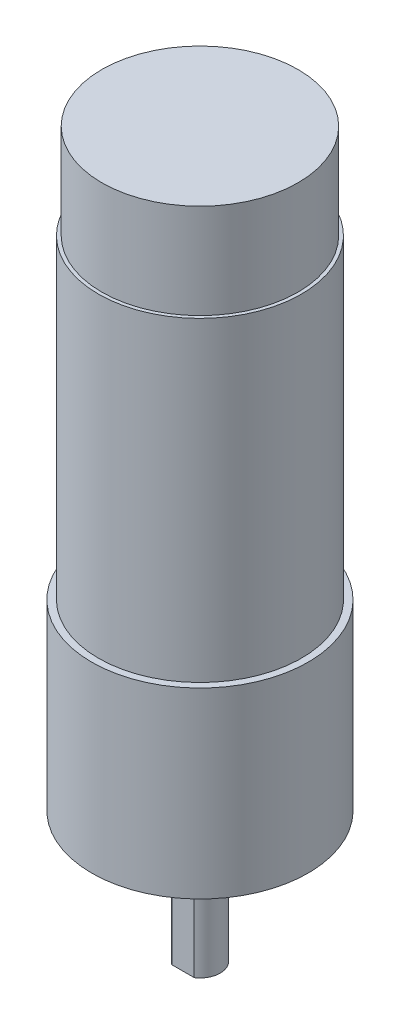
ISO-10303-21;
HEADER;
FILE_DESCRIPTION(('STEP AP214'),'2;1');
FILE_NAME('part.step','',(''),(''),'','','');
FILE_SCHEMA(('AUTOMOTIVE_DESIGN { 1 0 10303 214 1 1 1 1 }'));
ENDSEC;
DATA;
#1=APPLICATION_CONTEXT('core data for automotive mechanical design processes');
#2=APPLICATION_PROTOCOL_DEFINITION('international standard','automotive_design',2000,#1);
#3=PRODUCT_CONTEXT('',#1,'mechanical');
#4=PRODUCT('Part','Part','',(#3));
#5=PRODUCT_RELATED_PRODUCT_CATEGORY('part','',(#4));
#6=PRODUCT_DEFINITION_FORMATION('','',#4);
#7=PRODUCT_DEFINITION_CONTEXT('part definition',#1,'design');
#8=PRODUCT_DEFINITION('design','',#6,#7);
#9=PRODUCT_DEFINITION_SHAPE('','',#8);
#10=(LENGTH_UNIT() NAMED_UNIT(*) SI_UNIT(.MILLI.,.METRE.));
#11=(NAMED_UNIT(*) PLANE_ANGLE_UNIT() SI_UNIT($,.RADIAN.));
#12=(NAMED_UNIT(*) SI_UNIT($,.STERADIAN.) SOLID_ANGLE_UNIT());
#13=UNCERTAINTY_MEASURE_WITH_UNIT(LENGTH_MEASURE(1.E-05),#10,'distance_accuracy_value','');
#14=(GEOMETRIC_REPRESENTATION_CONTEXT(3) GLOBAL_UNCERTAINTY_ASSIGNED_CONTEXT((#13)) GLOBAL_UNIT_ASSIGNED_CONTEXT((#10,
#11,#12)) REPRESENTATION_CONTEXT('',''));
#15=CARTESIAN_POINT('',(0.,0.,0.));
#16=DIRECTION('',(0.,0.,1.));
#17=DIRECTION('',(1.,0.,0.));
#18=AXIS2_PLACEMENT_3D('',#15,#16,#17);
#19=CARTESIAN_POINT('',(0.,73.6,0.));
#20=DIRECTION('',(0.,1.,0.));
#21=DIRECTION('',(0.,0.,1.));
#22=AXIS2_PLACEMENT_3D('',#19,#20,#21);
#23=PLANE('',#22);
#24=CARTESIAN_POINT('',(0.,73.6,0.));
#25=DIRECTION('',(0.,1.,0.));
#26=DIRECTION('',(0.,0.,1.));
#27=AXIS2_PLACEMENT_3D('',#24,#25,#26);
#28=CIRCLE('',#27,15.);
#29=CARTESIAN_POINT('',(0.,73.6,15.));
#30=VERTEX_POINT('',#29);
#31=EDGE_CURVE('E92',#30,#30,#28,.T.);
#32=ORIENTED_EDGE('',*,*,#31,.T.);
#33=EDGE_LOOP('',(#32));
#34=FACE_BOUND('',#33,.T.);
#35=CARTESIAN_POINT('',(0.,73.6,0.));
#36=DIRECTION('',(0.,1.,0.));
#37=DIRECTION('',(0.,0.,1.));
#38=AXIS2_PLACEMENT_3D('',#35,#36,#37);
#39=CIRCLE('',#38,14.5);
#40=CARTESIAN_POINT('',(0.,73.6,14.5));
#41=VERTEX_POINT('',#40);
#42=EDGE_CURVE('E404',#41,#41,#39,.T.);
#43=ORIENTED_EDGE('',*,*,#42,.F.);
#44=EDGE_LOOP('',(#43));
#45=FACE_BOUND('',#44,.T.);
#46=ADVANCED_FACE('F32',(#34,#45),#23,.T.);
#47=CARTESIAN_POINT('',(0.,27.,0.));
#48=DIRECTION('',(0.,1.,0.));
#49=DIRECTION('',(0.,0.,1.));
#50=AXIS2_PLACEMENT_3D('',#47,#48,#49);
#51=PLANE('',#50);
#52=CARTESIAN_POINT('',(0.,27.,0.));
#53=DIRECTION('',(0.,1.,0.));
#54=DIRECTION('',(0.,0.,1.));
#55=AXIS2_PLACEMENT_3D('',#52,#53,#54);
#56=CIRCLE('',#55,16.);
#57=CARTESIAN_POINT('',(0.,27.,16.));
#58=VERTEX_POINT('',#57);
#59=EDGE_CURVE('E40',#58,#58,#56,.T.);
#60=ORIENTED_EDGE('',*,*,#59,.T.);
#61=EDGE_LOOP('',(#60));
#62=FACE_BOUND('',#61,.T.);
#63=CARTESIAN_POINT('',(0.,27.,0.));
#64=DIRECTION('',(0.,1.,0.));
#65=DIRECTION('',(0.,0.,1.));
#66=AXIS2_PLACEMENT_3D('',#63,#64,#65);
#67=CIRCLE('',#66,15.);
#68=CARTESIAN_POINT('',(0.,27.,15.));
#69=VERTEX_POINT('',#68);
#70=EDGE_CURVE('E432',#69,#69,#67,.T.);
#71=ORIENTED_EDGE('',*,*,#70,.F.);
#72=EDGE_LOOP('',(#71));
#73=FACE_BOUND('',#72,.T.);
#74=ADVANCED_FACE('F139',(#62,#73),#51,.T.);
#75=CARTESIAN_POINT('',(0.,-3.,0.));
#76=DIRECTION('',(0.,1.,0.));
#77=DIRECTION('',(0.,0.,1.));
#78=AXIS2_PLACEMENT_3D('',#75,#76,#77);
#79=PLANE('',#78);
#80=CARTESIAN_POINT('',(0.,-3.,0.));
#81=DIRECTION('',(0.,-1.,0.));
#82=DIRECTION('',(0.,0.,1.));
#83=AXIS2_PLACEMENT_3D('',#80,#81,#82);
#84=CIRCLE('',#83,10.);
#85=CARTESIAN_POINT('',(9.,-3.,4.35889894354067));
#86=VERTEX_POINT('',#85);
#87=CARTESIAN_POINT('',(-9.,-3.,4.35889894354068));
#88=VERTEX_POINT('',#87);
#89=EDGE_CURVE('E114',#86,#88,#84,.T.);
#90=ORIENTED_EDGE('',*,*,#89,.T.);
#91=DIRECTION('',(0.,0.,-1.));
#92=VECTOR('',#91,1.);
#93=CARTESIAN_POINT('',(-9.,-3.,4.35889894354068));
#94=LINE('',#93,#92);
#95=CARTESIAN_POINT('',(-9.,-3.,-4.35889894354068));
#96=VERTEX_POINT('',#95);
#97=EDGE_CURVE('E117',#88,#96,#94,.T.);
#98=ORIENTED_EDGE('',*,*,#97,.T.);
#99=CARTESIAN_POINT('',(0.,-3.,0.));
#100=DIRECTION('',(0.,-1.,0.));
#101=DIRECTION('',(0.,0.,1.));
#102=AXIS2_PLACEMENT_3D('',#99,#100,#101);
#103=CIRCLE('',#102,9.99999999999999);
#104=CARTESIAN_POINT('',(9.,-3.,-4.35889894354067));
#105=VERTEX_POINT('',#104);
#106=EDGE_CURVE('E119',#96,#105,#103,.T.);
#107=ORIENTED_EDGE('',*,*,#106,.T.);
#108=DIRECTION('',(0.,0.,1.));
#109=VECTOR('',#108,1.);
#110=CARTESIAN_POINT('',(9.,-3.,4.35889894354067));
#111=LINE('',#110,#109);
#112=EDGE_CURVE('E121',#105,#86,#111,.T.);
#113=ORIENTED_EDGE('',*,*,#112,.T.);
#114=EDGE_LOOP('',(#90,#98,#107,#113));
#115=FACE_BOUND('',#114,.T.);
#116=CARTESIAN_POINT('',(0.,-3.,0.));
#117=DIRECTION('',(0.,1.,0.));
#118=DIRECTION('',(0.,0.,1.));
#119=AXIS2_PLACEMENT_3D('',#116,#117,#118);
#120=CIRCLE('',#119,3.);
#121=CARTESIAN_POINT('',(0.,-3.,3.));
#122=VERTEX_POINT('',#121);
#123=EDGE_CURVE('E11',#122,#122,#120,.F.);
#124=ORIENTED_EDGE('',*,*,#123,.F.);
#125=EDGE_LOOP('',(#124));
#126=FACE_BOUND('',#125,.T.);
#127=ADVANCED_FACE('F149',(#115,#126),#79,.F.);
#128=CARTESIAN_POINT('',(0.,0.,0.));
#129=DIRECTION('',(0.,1.,0.));
#130=DIRECTION('',(0.,0.,1.));
#131=AXIS2_PLACEMENT_3D('',#128,#129,#130);
#132=PLANE('',#131);
#133=CARTESIAN_POINT('',(-9.1923881554251,0.,-9.19238815542513));
#134=DIRECTION('',(0.,-1.,0.));
#135=DIRECTION('',(0.,0.,-1.));
#136=AXIS2_PLACEMENT_3D('',#133,#134,#135);
#137=CIRCLE('',#136,1.5);
#138=CARTESIAN_POINT('',(-9.1923881554251,0.,-10.6923881554251));
#139=VERTEX_POINT('',#138);
#140=EDGE_CURVE('E403',#139,#139,#137,.T.);
#141=ORIENTED_EDGE('',*,*,#140,.F.);
#142=EDGE_LOOP('',(#141));
#143=FACE_BOUND('',#142,.T.);
#144=CARTESIAN_POINT('',(9.1923881554251,0.,-9.19238815542513));
#145=DIRECTION('',(0.,-1.,0.));
#146=DIRECTION('',(0.,0.,1.));
#147=AXIS2_PLACEMENT_3D('',#144,#145,#146);
#148=CIRCLE('',#147,1.5);
#149=CARTESIAN_POINT('',(9.1923881554251,0.,-7.69238815542513));
#150=VERTEX_POINT('',#149);
#151=EDGE_CURVE('E414',#150,#150,#148,.T.);
#152=ORIENTED_EDGE('',*,*,#151,.F.);
#153=EDGE_LOOP('',(#152));
#154=FACE_BOUND('',#153,.T.);
#155=CARTESIAN_POINT('',(-9.1923881554251,0.,9.19238815542513));
#156=DIRECTION('',(0.,-1.,0.));
#157=DIRECTION('',(0.,0.,1.));
#158=AXIS2_PLACEMENT_3D('',#155,#156,#157);
#159=CIRCLE('',#158,1.5);
#160=CARTESIAN_POINT('',(-9.1923881554251,0.,10.6923881554251));
#161=VERTEX_POINT('',#160);
#162=EDGE_CURVE('E420',#161,#161,#159,.T.);
#163=ORIENTED_EDGE('',*,*,#162,.F.);
#164=EDGE_LOOP('',(#163));
#165=FACE_BOUND('',#164,.T.);
#166=CARTESIAN_POINT('',(9.1923881554251,0.,9.19238815542513));
#167=DIRECTION('',(0.,-1.,0.));
#168=DIRECTION('',(0.,0.,-1.));
#169=AXIS2_PLACEMENT_3D('',#166,#167,#168);
#170=CIRCLE('',#169,1.5);
#171=CARTESIAN_POINT('',(9.1923881554251,0.,7.69238815542513));
#172=VERTEX_POINT('',#171);
#173=EDGE_CURVE('E426',#172,#172,#170,.T.);
#174=ORIENTED_EDGE('',*,*,#173,.F.);
#175=EDGE_LOOP('',(#174));
#176=FACE_BOUND('',#175,.T.);
#177=CARTESIAN_POINT('',(0.,0.,0.));
#178=DIRECTION('',(0.,1.,0.));
#179=DIRECTION('',(0.,0.,1.));
#180=AXIS2_PLACEMENT_3D('',#177,#178,#179);
#181=CIRCLE('',#180,16.);
#182=CARTESIAN_POINT('',(0.,0.,16.));
#183=VERTEX_POINT('',#182);
#184=EDGE_CURVE('E134',#183,#183,#181,.T.);
#185=ORIENTED_EDGE('',*,*,#184,.F.);
#186=EDGE_LOOP('',(#185));
#187=FACE_BOUND('',#186,.T.);
#188=CARTESIAN_POINT('',(0.,0.,0.));
#189=DIRECTION('',(0.,-1.,0.));
#190=DIRECTION('',(0.,0.,1.));
#191=AXIS2_PLACEMENT_3D('',#188,#189,#190);
#192=CIRCLE('',#191,10.);
#193=CARTESIAN_POINT('',(9.,0.,4.35889894354067));
#194=VERTEX_POINT('',#193);
#195=CARTESIAN_POINT('',(-9.,0.,4.35889894354068));
#196=VERTEX_POINT('',#195);
#197=EDGE_CURVE('E101',#194,#196,#192,.T.);
#198=ORIENTED_EDGE('',*,*,#197,.F.);
#199=DIRECTION('',(0.,0.,1.));
#200=VECTOR('',#199,1.);
#201=CARTESIAN_POINT('',(9.,0.,4.35889894354067));
#202=LINE('',#201,#200);
#203=CARTESIAN_POINT('',(9.,0.,-4.35889894354067));
#204=VERTEX_POINT('',#203);
#205=EDGE_CURVE('E111',#204,#194,#202,.T.);
#206=ORIENTED_EDGE('',*,*,#205,.F.);
#207=CARTESIAN_POINT('',(0.,0.,0.));
#208=DIRECTION('',(0.,-1.,0.));
#209=DIRECTION('',(0.,0.,1.));
#210=AXIS2_PLACEMENT_3D('',#207,#208,#209);
#211=CIRCLE('',#210,9.99999999999999);
#212=CARTESIAN_POINT('',(-9.,0.,-4.35889894354068));
#213=VERTEX_POINT('',#212);
#214=EDGE_CURVE('E108',#213,#204,#211,.T.);
#215=ORIENTED_EDGE('',*,*,#214,.F.);
#216=DIRECTION('',(0.,0.,-1.));
#217=VECTOR('',#216,1.);
#218=CARTESIAN_POINT('',(-9.,0.,4.35889894354068));
#219=LINE('',#218,#217);
#220=EDGE_CURVE('E55',#196,#213,#219,.T.);
#221=ORIENTED_EDGE('',*,*,#220,.F.);
#222=EDGE_LOOP('',(#198,#206,#215,#221));
#223=FACE_BOUND('',#222,.T.);
#224=ADVANCED_FACE('F145',(#143,#154,#165,#176,#187,#223),#132,.F.);
#225=CARTESIAN_POINT('',(0.,27.,0.));
#226=DIRECTION('',(0.,-1.,0.));
#227=DIRECTION('',(0.,0.,-1.));
#228=AXIS2_PLACEMENT_3D('',#225,#226,#227);
#229=CYLINDRICAL_SURFACE('',#228,16.);
#230=ORIENTED_EDGE('',*,*,#59,.F.);
#231=EDGE_LOOP('',(#230));
#232=FACE_BOUND('',#231,.T.);
#233=ORIENTED_EDGE('',*,*,#184,.T.);
#234=EDGE_LOOP('',(#233));
#235=FACE_BOUND('',#234,.T.);
#236=ADVANCED_FACE('F34',(#232,#235),#229,.T.);
#237=CARTESIAN_POINT('',(0.,-3.,0.));
#238=DIRECTION('',(0.,1.,0.));
#239=DIRECTION('',(0.,0.,1.));
#240=AXIS2_PLACEMENT_3D('',#237,#238,#239);
#241=CYLINDRICAL_SURFACE('',#240,10.);
#242=ORIENTED_EDGE('',*,*,#197,.T.);
#243=DIRECTION('',(0.,1.,0.));
#244=VECTOR('',#243,1.);
#245=CARTESIAN_POINT('',(-9.,-3.,4.35889894354068));
#246=LINE('',#245,#244);
#247=EDGE_CURVE('E132',#88,#196,#246,.T.);
#248=ORIENTED_EDGE('',*,*,#247,.F.);
#249=ORIENTED_EDGE('',*,*,#89,.F.);
#250=DIRECTION('',(0.,1.,0.));
#251=VECTOR('',#250,1.);
#252=CARTESIAN_POINT('',(9.,-3.,4.35889894354067));
#253=LINE('',#252,#251);
#254=EDGE_CURVE('E123',#86,#194,#253,.T.);
#255=ORIENTED_EDGE('',*,*,#254,.T.);
#256=EDGE_LOOP('',(#242,#248,#249,#255));
#257=FACE_BOUND('',#256,.T.);
#258=ADVANCED_FACE('F144',(#257),#241,.T.);
#259=CARTESIAN_POINT('',(-9.,-3.,4.35889894354068));
#260=DIRECTION('',(1.,0.,0.));
#261=DIRECTION('',(0.,0.,-1.));
#262=AXIS2_PLACEMENT_3D('',#259,#260,#261);
#263=PLANE('',#262);
#264=ORIENTED_EDGE('',*,*,#220,.T.);
#265=DIRECTION('',(0.,1.,0.));
#266=VECTOR('',#265,1.);
#267=CARTESIAN_POINT('',(-9.,-3.,-4.35889894354068));
#268=LINE('',#267,#266);
#269=EDGE_CURVE('E129',#96,#213,#268,.T.);
#270=ORIENTED_EDGE('',*,*,#269,.F.);
#271=ORIENTED_EDGE('',*,*,#97,.F.);
#272=ORIENTED_EDGE('',*,*,#247,.T.);
#273=EDGE_LOOP('',(#264,#270,#271,#272));
#274=FACE_BOUND('',#273,.T.);
#275=ADVANCED_FACE('F167',(#274),#263,.F.);
#276=CARTESIAN_POINT('',(0.,-3.,0.));
#277=DIRECTION('',(0.,1.,0.));
#278=DIRECTION('',(0.,0.,1.));
#279=AXIS2_PLACEMENT_3D('',#276,#277,#278);
#280=CYLINDRICAL_SURFACE('',#279,9.99999999999999);
#281=ORIENTED_EDGE('',*,*,#214,.T.);
#282=DIRECTION('',(0.,1.,0.));
#283=VECTOR('',#282,1.);
#284=CARTESIAN_POINT('',(9.,-3.,-4.35889894354067));
#285=LINE('',#284,#283);
#286=EDGE_CURVE('E126',#105,#204,#285,.T.);
#287=ORIENTED_EDGE('',*,*,#286,.F.);
#288=ORIENTED_EDGE('',*,*,#106,.F.);
#289=ORIENTED_EDGE('',*,*,#269,.T.);
#290=EDGE_LOOP('',(#281,#287,#288,#289));
#291=FACE_BOUND('',#290,.T.);
#292=ADVANCED_FACE('F165',(#291),#280,.T.);
#293=CARTESIAN_POINT('',(9.,-3.,4.35889894354067));
#294=DIRECTION('',(-1.,0.,0.));
#295=DIRECTION('',(0.,0.,1.));
#296=AXIS2_PLACEMENT_3D('',#293,#294,#295);
#297=PLANE('',#296);
#298=ORIENTED_EDGE('',*,*,#205,.T.);
#299=ORIENTED_EDGE('',*,*,#254,.F.);
#300=ORIENTED_EDGE('',*,*,#112,.F.);
#301=ORIENTED_EDGE('',*,*,#286,.T.);
#302=EDGE_LOOP('',(#298,#299,#300,#301));
#303=FACE_BOUND('',#302,.T.);
#304=ADVANCED_FACE('F156',(#303),#297,.F.);
#305=CARTESIAN_POINT('',(0.,-19.3,0.));
#306=DIRECTION('',(0.,1.,0.));
#307=DIRECTION('',(0.,0.,1.));
#308=AXIS2_PLACEMENT_3D('',#305,#306,#307);
#309=CYLINDRICAL_SURFACE('',#308,3.);
#310=CARTESIAN_POINT('',(0.,-19.3,0.));
#311=DIRECTION('',(0.,-1.,0.));
#312=DIRECTION('',(0.,0.,-1.));
#313=AXIS2_PLACEMENT_3D('',#310,#311,#312);
#314=CIRCLE('',#313,3.);
#315=CARTESIAN_POINT('',(-1.6583123951777,-19.3,2.5));
#316=VERTEX_POINT('',#315);
#317=CARTESIAN_POINT('',(1.6583123951777,-19.3,2.5));
#318=VERTEX_POINT('',#317);
#319=EDGE_CURVE('E98',#316,#318,#314,.T.);
#320=ORIENTED_EDGE('',*,*,#319,.F.);
#321=DIRECTION('',(0.,-1.,0.));
#322=VECTOR('',#321,1.);
#323=CARTESIAN_POINT('',(-1.6583123951777,-7.3,2.5));
#324=LINE('',#323,#322);
#325=CARTESIAN_POINT('',(-1.6583123951777,-7.3,2.5));
#326=VERTEX_POINT('',#325);
#327=EDGE_CURVE('E47',#326,#316,#324,.T.);
#328=ORIENTED_EDGE('',*,*,#327,.F.);
#329=CARTESIAN_POINT('',(0.,-7.3,0.));
#330=DIRECTION('',(0.,-1.,0.));
#331=DIRECTION('',(0.,0.,-1.));
#332=AXIS2_PLACEMENT_3D('',#329,#330,#331);
#333=CIRCLE('',#332,3.);
#334=CARTESIAN_POINT('',(1.6583123951777,-7.3,2.5));
#335=VERTEX_POINT('',#334);
#336=EDGE_CURVE('E91',#335,#326,#333,.T.);
#337=ORIENTED_EDGE('',*,*,#336,.F.);
#338=DIRECTION('',(0.,-1.,0.));
#339=VECTOR('',#338,1.);
#340=CARTESIAN_POINT('',(1.6583123951777,-7.3,2.5));
#341=LINE('',#340,#339);
#342=EDGE_CURVE('E86',#335,#318,#341,.T.);
#343=ORIENTED_EDGE('',*,*,#342,.T.);
#344=EDGE_LOOP('',(#320,#328,#337,#343));
#345=FACE_BOUND('',#344,.T.);
#346=ORIENTED_EDGE('',*,*,#123,.T.);
#347=EDGE_LOOP('',(#346));
#348=FACE_BOUND('',#347,.T.);
#349=ADVANCED_FACE('F96',(#345,#348),#309,.T.);
#350=CARTESIAN_POINT('',(0.,-19.3,0.));
#351=DIRECTION('',(0.,-1.,0.));
#352=DIRECTION('',(0.,0.,-1.));
#353=AXIS2_PLACEMENT_3D('',#350,#351,#352);
#354=PLANE('',#353);
#355=DIRECTION('',(1.,0.,0.));
#356=VECTOR('',#355,1.);
#357=CARTESIAN_POINT('',(0.,-19.3,2.5));
#358=LINE('',#357,#356);
#359=EDGE_CURVE('E83',#316,#318,#358,.T.);
#360=ORIENTED_EDGE('',*,*,#359,.F.);
#361=ORIENTED_EDGE('',*,*,#319,.T.);
#362=EDGE_LOOP('',(#360,#361));
#363=FACE_BOUND('',#362,.T.);
#364=ADVANCED_FACE('F100',(#363),#354,.T.);
#365=CARTESIAN_POINT('',(0.,-7.3,2.5));
#366=DIRECTION('',(0.,0.,-1.));
#367=DIRECTION('',(-1.,0.,0.));
#368=AXIS2_PLACEMENT_3D('',#365,#366,#367);
#369=PLANE('',#368);
#370=ORIENTED_EDGE('',*,*,#359,.T.);
#371=ORIENTED_EDGE('',*,*,#342,.F.);
#372=DIRECTION('',(1.,0.,0.));
#373=VECTOR('',#372,1.);
#374=CARTESIAN_POINT('',(0.,-7.3,2.5));
#375=LINE('',#374,#373);
#376=EDGE_CURVE('E437',#326,#335,#375,.T.);
#377=ORIENTED_EDGE('',*,*,#376,.F.);
#378=ORIENTED_EDGE('',*,*,#327,.T.);
#379=EDGE_LOOP('',(#370,#371,#377,#378));
#380=FACE_BOUND('',#379,.T.);
#381=ADVANCED_FACE('F85',(#380),#369,.F.);
#382=CARTESIAN_POINT('',(0.,-7.3,-6.74142135623731));
#383=DIRECTION('',(0.,-1.,0.));
#384=DIRECTION('',(0.,0.,-1.));
#385=AXIS2_PLACEMENT_3D('',#382,#383,#384);
#386=PLANE('',#385);
#387=ORIENTED_EDGE('',*,*,#336,.T.);
#388=ORIENTED_EDGE('',*,*,#376,.T.);
#389=EDGE_LOOP('',(#387,#388));
#390=FACE_BOUND('',#389,.T.);
#391=ADVANCED_FACE('F191',(#390),#386,.T.);
#392=CARTESIAN_POINT('',(0.,73.6,0.));
#393=DIRECTION('',(0.,-1.,0.));
#394=DIRECTION('',(0.,0.,-1.));
#395=AXIS2_PLACEMENT_3D('',#392,#393,#394);
#396=CYLINDRICAL_SURFACE('',#395,15.);
#397=ORIENTED_EDGE('',*,*,#31,.F.);
#398=EDGE_LOOP('',(#397));
#399=FACE_BOUND('',#398,.T.);
#400=ORIENTED_EDGE('',*,*,#70,.T.);
#401=EDGE_LOOP('',(#400));
#402=FACE_BOUND('',#401,.T.);
#403=ADVANCED_FACE('F188',(#399,#402),#396,.T.);
#404=CARTESIAN_POINT('',(9.1923881554251,5.5,9.19238815542513));
#405=DIRECTION('',(0.,-1.,0.));
#406=DIRECTION('',(0.,0.,-1.));
#407=AXIS2_PLACEMENT_3D('',#404,#405,#406);
#408=CYLINDRICAL_SURFACE('',#407,1.5);
#409=CARTESIAN_POINT('',(9.1923881554251,5.5,9.19238815542513));
#410=DIRECTION('',(0.,-1.,0.));
#411=DIRECTION('',(0.,0.,-1.));
#412=AXIS2_PLACEMENT_3D('',#409,#410,#411);
#413=CIRCLE('',#412,1.5);
#414=CARTESIAN_POINT('',(9.1923881554251,5.5,7.69238815542513));
#415=VERTEX_POINT('',#414);
#416=EDGE_CURVE('E429',#415,#415,#413,.T.);
#417=ORIENTED_EDGE('',*,*,#416,.F.);
#418=EDGE_LOOP('',(#417));
#419=FACE_BOUND('',#418,.T.);
#420=ORIENTED_EDGE('',*,*,#173,.T.);
#421=EDGE_LOOP('',(#420));
#422=FACE_BOUND('',#421,.T.);
#423=ADVANCED_FACE('F186',(#419,#422),#408,.F.);
#424=CARTESIAN_POINT('',(9.1923881554251,5.5,9.19238815542513));
#425=DIRECTION('',(0.,-1.,0.));
#426=DIRECTION('',(0.,0.,-1.));
#427=AXIS2_PLACEMENT_3D('',#424,#425,#426);
#428=PLANE('',#427);
#429=ORIENTED_EDGE('',*,*,#416,.T.);
#430=EDGE_LOOP('',(#429));
#431=FACE_BOUND('',#430,.T.);
#432=ADVANCED_FACE('F240',(#431),#428,.T.);
#433=CARTESIAN_POINT('',(-9.1923881554251,5.5,9.19238815542513));
#434=DIRECTION('',(0.,-1.,0.));
#435=DIRECTION('',(0.,0.,-1.));
#436=AXIS2_PLACEMENT_3D('',#433,#434,#435);
#437=CYLINDRICAL_SURFACE('',#436,1.5);
#438=CARTESIAN_POINT('',(-9.1923881554251,5.5,9.19238815542513));
#439=DIRECTION('',(0.,-1.,0.));
#440=DIRECTION('',(0.,0.,1.));
#441=AXIS2_PLACEMENT_3D('',#438,#439,#440);
#442=CIRCLE('',#441,1.5);
#443=CARTESIAN_POINT('',(-9.1923881554251,5.5,10.6923881554251));
#444=VERTEX_POINT('',#443);
#445=EDGE_CURVE('E423',#444,#444,#442,.T.);
#446=ORIENTED_EDGE('',*,*,#445,.F.);
#447=EDGE_LOOP('',(#446));
#448=FACE_BOUND('',#447,.T.);
#449=ORIENTED_EDGE('',*,*,#162,.T.);
#450=EDGE_LOOP('',(#449));
#451=FACE_BOUND('',#450,.T.);
#452=ADVANCED_FACE('F247',(#448,#451),#437,.F.);
#453=CARTESIAN_POINT('',(-9.1923881554251,5.5,9.19238815542513));
#454=DIRECTION('',(0.,1.,0.));
#455=DIRECTION('',(0.,0.,1.));
#456=AXIS2_PLACEMENT_3D('',#453,#454,#455);
#457=PLANE('',#456);
#458=ORIENTED_EDGE('',*,*,#445,.T.);
#459=EDGE_LOOP('',(#458));
#460=FACE_BOUND('',#459,.T.);
#461=ADVANCED_FACE('F254',(#460),#457,.F.);
#462=CARTESIAN_POINT('',(9.1923881554251,5.5,-9.19238815542513));
#463=DIRECTION('',(0.,-1.,0.));
#464=DIRECTION('',(0.,0.,-1.));
#465=AXIS2_PLACEMENT_3D('',#462,#463,#464);
#466=CYLINDRICAL_SURFACE('',#465,1.5);
#467=CARTESIAN_POINT('',(9.1923881554251,5.5,-9.19238815542513));
#468=DIRECTION('',(0.,-1.,0.));
#469=DIRECTION('',(0.,0.,1.));
#470=AXIS2_PLACEMENT_3D('',#467,#468,#469);
#471=CIRCLE('',#470,1.5);
#472=CARTESIAN_POINT('',(9.1923881554251,5.5,-7.69238815542513));
#473=VERTEX_POINT('',#472);
#474=EDGE_CURVE('E417',#473,#473,#471,.T.);
#475=ORIENTED_EDGE('',*,*,#474,.F.);
#476=EDGE_LOOP('',(#475));
#477=FACE_BOUND('',#476,.T.);
#478=ORIENTED_EDGE('',*,*,#151,.T.);
#479=EDGE_LOOP('',(#478));
#480=FACE_BOUND('',#479,.T.);
#481=ADVANCED_FACE('F262',(#477,#480),#466,.F.);
#482=CARTESIAN_POINT('',(9.1923881554251,5.5,-9.19238815542513));
#483=DIRECTION('',(0.,1.,0.));
#484=DIRECTION('',(0.,0.,1.));
#485=AXIS2_PLACEMENT_3D('',#482,#483,#484);
#486=PLANE('',#485);
#487=ORIENTED_EDGE('',*,*,#474,.T.);
#488=EDGE_LOOP('',(#487));
#489=FACE_BOUND('',#488,.T.);
#490=ADVANCED_FACE('F270',(#489),#486,.F.);
#491=CARTESIAN_POINT('',(-9.1923881554251,5.5,-9.19238815542513));
#492=DIRECTION('',(0.,-1.,0.));
#493=DIRECTION('',(0.,0.,-1.));
#494=AXIS2_PLACEMENT_3D('',#491,#492,#493);
#495=CYLINDRICAL_SURFACE('',#494,1.5);
#496=CARTESIAN_POINT('',(-9.1923881554251,5.5,-9.19238815542513));
#497=DIRECTION('',(0.,-1.,0.));
#498=DIRECTION('',(0.,0.,-1.));
#499=AXIS2_PLACEMENT_3D('',#496,#497,#498);
#500=CIRCLE('',#499,1.5);
#501=CARTESIAN_POINT('',(-9.1923881554251,5.5,-10.6923881554251));
#502=VERTEX_POINT('',#501);
#503=EDGE_CURVE('E407',#502,#502,#500,.T.);
#504=ORIENTED_EDGE('',*,*,#503,.F.);
#505=EDGE_LOOP('',(#504));
#506=FACE_BOUND('',#505,.T.);
#507=ORIENTED_EDGE('',*,*,#140,.T.);
#508=EDGE_LOOP('',(#507));
#509=FACE_BOUND('',#508,.T.);
#510=ADVANCED_FACE('F278',(#506,#509),#495,.F.);
#511=CARTESIAN_POINT('',(-9.1923881554251,5.5,-9.19238815542513));
#512=DIRECTION('',(0.,-1.,0.));
#513=DIRECTION('',(0.,0.,-1.));
#514=AXIS2_PLACEMENT_3D('',#511,#512,#513);
#515=PLANE('',#514);
#516=ORIENTED_EDGE('',*,*,#503,.T.);
#517=EDGE_LOOP('',(#516));
#518=FACE_BOUND('',#517,.T.);
#519=ADVANCED_FACE('F286',(#518),#515,.T.);
#520=CARTESIAN_POINT('',(0.,87.6,0.));
#521=DIRECTION('',(0.,-1.,0.));
#522=DIRECTION('',(0.,0.,-1.));
#523=AXIS2_PLACEMENT_3D('',#520,#521,#522);
#524=CYLINDRICAL_SURFACE('',#523,14.5);
#525=CARTESIAN_POINT('',(0.,87.6,0.));
#526=DIRECTION('',(0.,1.,0.));
#527=DIRECTION('',(0.,0.,1.));
#528=AXIS2_PLACEMENT_3D('',#525,#526,#527);
#529=CIRCLE('',#528,14.5);
#530=CARTESIAN_POINT('',(0.,87.6,14.5));
#531=VERTEX_POINT('',#530);
#532=EDGE_CURVE('E402',#531,#531,#529,.T.);
#533=ORIENTED_EDGE('',*,*,#532,.F.);
#534=EDGE_LOOP('',(#533));
#535=FACE_BOUND('',#534,.T.);
#536=ORIENTED_EDGE('',*,*,#42,.T.);
#537=EDGE_LOOP('',(#536));
#538=FACE_BOUND('',#537,.T.);
#539=ADVANCED_FACE('F294',(#535,#538),#524,.T.);
#540=CARTESIAN_POINT('',(0.,87.6,0.));
#541=DIRECTION('',(0.,1.,0.));
#542=DIRECTION('',(0.,0.,1.));
#543=AXIS2_PLACEMENT_3D('',#540,#541,#542);
#544=PLANE('',#543);
#545=ORIENTED_EDGE('',*,*,#532,.T.);
#546=EDGE_LOOP('',(#545));
#547=FACE_BOUND('',#546,.T.);
#548=ADVANCED_FACE('F302',(#547),#544,.T.);
#549=CLOSED_SHELL('',(#46,#74,#127,#224,#236,#258,#275,#292,#304,#349,#364,#381,#391,#403,#423,
#432,#452,#461,#481,#490,#510,#519,#539,#548));
#550=MANIFOLD_SOLID_BREP('B2',#549);
#551=ADVANCED_BREP_SHAPE_REPRESENTATION('',(#18,#550),#14);
#552=SHAPE_DEFINITION_REPRESENTATION(#9,#551);
ENDSEC;
END-ISO-10303-21;
